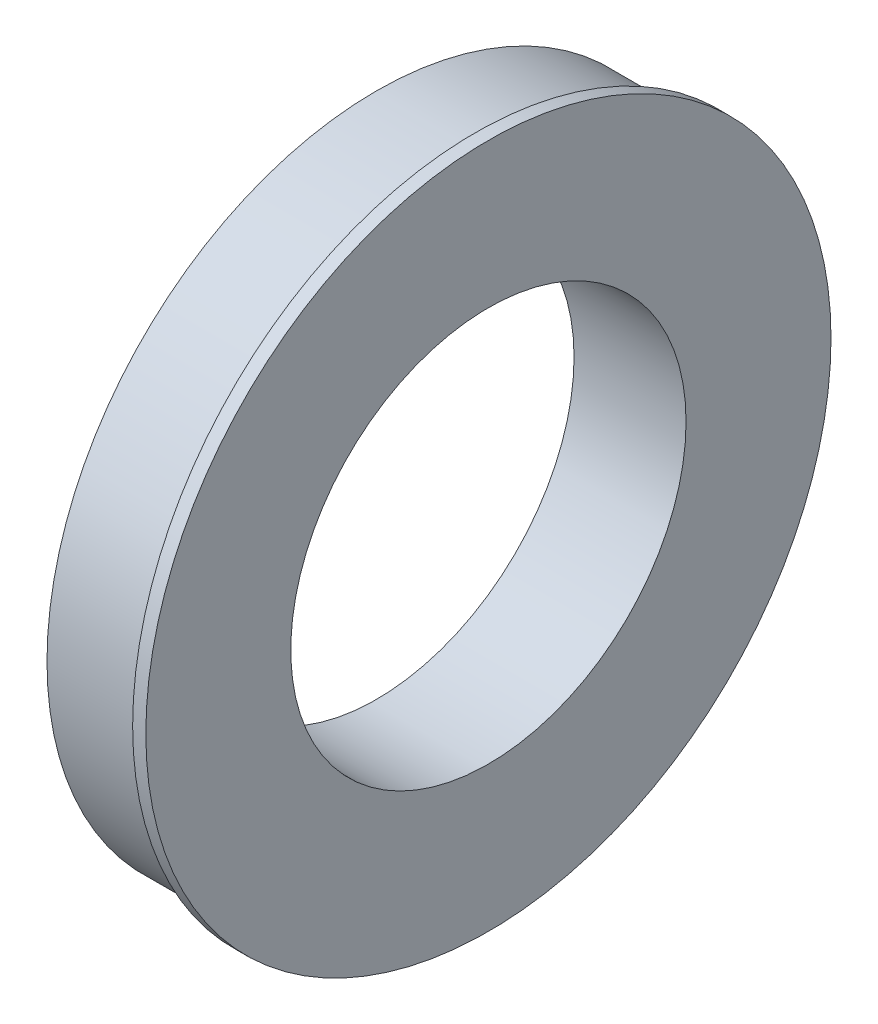
ISO-10303-21;
HEADER;
FILE_DESCRIPTION(('STEP AP214'),'2;1');
FILE_NAME('part.step','',(''),(''),'','','');
FILE_SCHEMA(('AUTOMOTIVE_DESIGN { 1 0 10303 214 1 1 1 1 }'));
ENDSEC;
DATA;
#1=APPLICATION_CONTEXT('core data for automotive mechanical design processes');
#2=APPLICATION_PROTOCOL_DEFINITION('international standard','automotive_design',2000,#1);
#3=PRODUCT_CONTEXT('',#1,'mechanical');
#4=PRODUCT('Part','Part','',(#3));
#5=PRODUCT_RELATED_PRODUCT_CATEGORY('part','',(#4));
#6=PRODUCT_DEFINITION_FORMATION('','',#4);
#7=PRODUCT_DEFINITION_CONTEXT('part definition',#1,'design');
#8=PRODUCT_DEFINITION('design','',#6,#7);
#9=PRODUCT_DEFINITION_SHAPE('','',#8);
#10=(LENGTH_UNIT() NAMED_UNIT(*) SI_UNIT(.MILLI.,.METRE.));
#11=(NAMED_UNIT(*) PLANE_ANGLE_UNIT() SI_UNIT($,.RADIAN.));
#12=(NAMED_UNIT(*) SI_UNIT($,.STERADIAN.) SOLID_ANGLE_UNIT());
#13=UNCERTAINTY_MEASURE_WITH_UNIT(LENGTH_MEASURE(1.E-05),#10,'distance_accuracy_value','');
#14=(GEOMETRIC_REPRESENTATION_CONTEXT(3) GLOBAL_UNCERTAINTY_ASSIGNED_CONTEXT((#13)) GLOBAL_UNIT_ASSIGNED_CONTEXT((#10,
#11,#12)) REPRESENTATION_CONTEXT('',''));
#15=CARTESIAN_POINT('',(0.,0.,0.));
#16=DIRECTION('',(0.,0.,1.));
#17=DIRECTION('',(1.,0.,0.));
#18=AXIS2_PLACEMENT_3D('',#15,#16,#17);
#19=CARTESIAN_POINT('',(-9.525,0.,0.));
#20=DIRECTION('',(1.,0.,0.));
#21=DIRECTION('',(0.,0.,-1.));
#22=AXIS2_PLACEMENT_3D('',#19,#20,#21);
#23=PLANE('',#22);
#24=CARTESIAN_POINT('',(-9.525,0.,0.));
#25=DIRECTION('',(1.,0.,0.));
#26=DIRECTION('',(0.,0.,-1.));
#27=AXIS2_PLACEMENT_3D('',#24,#25,#26);
#28=CIRCLE('',#27,63.5);
#29=CARTESIAN_POINT('',(-9.525,0.,-63.5));
#30=VERTEX_POINT('',#29);
#31=EDGE_CURVE('E45',#30,#30,#28,.T.);
#32=ORIENTED_EDGE('',*,*,#31,.F.);
#33=EDGE_LOOP('',(#32));
#34=FACE_BOUND('',#33,.T.);
#35=CARTESIAN_POINT('',(-9.525,0.,0.));
#36=DIRECTION('',(1.,0.,0.));
#37=DIRECTION('',(0.,0.,-1.));
#38=AXIS2_PLACEMENT_3D('',#35,#36,#37);
#39=CIRCLE('',#38,38.1);
#40=CARTESIAN_POINT('',(-9.525,0.,-38.1));
#41=VERTEX_POINT('',#40);
#42=EDGE_CURVE('E54',#41,#41,#39,.T.);
#43=ORIENTED_EDGE('',*,*,#42,.T.);
#44=EDGE_LOOP('',(#43));
#45=FACE_BOUND('',#44,.T.);
#46=ADVANCED_FACE('F41',(#34,#45),#23,.F.);
#47=CARTESIAN_POINT('',(9.525,0.,0.));
#48=DIRECTION('',(-1.,0.,0.));
#49=DIRECTION('',(0.,0.,1.));
#50=AXIS2_PLACEMENT_3D('',#47,#48,#49);
#51=CYLINDRICAL_SURFACE('',#50,63.5);
#52=CARTESIAN_POINT('',(9.525,0.,0.));
#53=DIRECTION('',(1.,0.,0.));
#54=DIRECTION('',(0.,0.,-1.));
#55=AXIS2_PLACEMENT_3D('',#52,#53,#54);
#56=CIRCLE('',#55,63.5);
#57=CARTESIAN_POINT('',(9.525,0.,-63.5));
#58=VERTEX_POINT('',#57);
#59=EDGE_CURVE('E10',#58,#58,#56,.T.);
#60=ORIENTED_EDGE('',*,*,#59,.F.);
#61=EDGE_LOOP('',(#60));
#62=FACE_BOUND('',#61,.T.);
#63=ORIENTED_EDGE('',*,*,#31,.T.);
#64=EDGE_LOOP('',(#63));
#65=FACE_BOUND('',#64,.T.);
#66=ADVANCED_FACE('F43',(#62,#65),#51,.T.);
#67=CARTESIAN_POINT('',(9.525,0.,0.));
#68=DIRECTION('',(-1.,0.,0.));
#69=DIRECTION('',(0.,0.,1.));
#70=AXIS2_PLACEMENT_3D('',#67,#68,#69);
#71=CYLINDRICAL_SURFACE('',#70,38.1);
#72=ORIENTED_EDGE('',*,*,#42,.F.);
#73=EDGE_LOOP('',(#72));
#74=FACE_BOUND('',#73,.T.);
#75=CARTESIAN_POINT('',(12.065,0.,0.));
#76=DIRECTION('',(1.,0.,0.));
#77=DIRECTION('',(0.,0.,-1.));
#78=AXIS2_PLACEMENT_3D('',#75,#76,#77);
#79=CIRCLE('',#78,38.1);
#80=CARTESIAN_POINT('',(12.065,0.,-38.1));
#81=VERTEX_POINT('',#80);
#82=EDGE_CURVE('E64',#81,#81,#79,.T.);
#83=ORIENTED_EDGE('',*,*,#82,.T.);
#84=EDGE_LOOP('',(#83));
#85=FACE_BOUND('',#84,.T.);
#86=ADVANCED_FACE('F72',(#74,#85),#71,.F.);
#87=CARTESIAN_POINT('',(12.065,0.,0.));
#88=DIRECTION('',(1.,0.,0.));
#89=DIRECTION('',(0.,0.,-1.));
#90=AXIS2_PLACEMENT_3D('',#87,#88,#89);
#91=PLANE('',#90);
#92=CARTESIAN_POINT('',(12.065,0.,0.));
#93=DIRECTION('',(1.,0.,0.));
#94=DIRECTION('',(0.,0.,-1.));
#95=AXIS2_PLACEMENT_3D('',#92,#93,#94);
#96=CIRCLE('',#95,66.04);
#97=CARTESIAN_POINT('',(12.065,0.,-66.04));
#98=VERTEX_POINT('',#97);
#99=EDGE_CURVE('E59',#98,#98,#96,.T.);
#100=ORIENTED_EDGE('',*,*,#99,.T.);
#101=EDGE_LOOP('',(#100));
#102=FACE_BOUND('',#101,.T.);
#103=ORIENTED_EDGE('',*,*,#82,.F.);
#104=EDGE_LOOP('',(#103));
#105=FACE_BOUND('',#104,.T.);
#106=ADVANCED_FACE('F74',(#102,#105),#91,.T.);
#107=CARTESIAN_POINT('',(9.525,0.,0.));
#108=DIRECTION('',(1.,0.,0.));
#109=DIRECTION('',(0.,0.,-1.));
#110=AXIS2_PLACEMENT_3D('',#107,#108,#109);
#111=PLANE('',#110);
#112=ORIENTED_EDGE('',*,*,#59,.T.);
#113=EDGE_LOOP('',(#112));
#114=FACE_BOUND('',#113,.T.);
#115=CARTESIAN_POINT('',(9.525,0.,0.));
#116=DIRECTION('',(1.,0.,0.));
#117=DIRECTION('',(0.,0.,-1.));
#118=AXIS2_PLACEMENT_3D('',#115,#116,#117);
#119=CIRCLE('',#118,66.04);
#120=CARTESIAN_POINT('',(9.525,0.,-66.04));
#121=VERTEX_POINT('',#120);
#122=EDGE_CURVE('E60',#121,#121,#119,.T.);
#123=ORIENTED_EDGE('',*,*,#122,.F.);
#124=EDGE_LOOP('',(#123));
#125=FACE_BOUND('',#124,.T.);
#126=ADVANCED_FACE('F76',(#114,#125),#111,.F.);
#127=CARTESIAN_POINT('',(12.065,0.,0.));
#128=DIRECTION('',(-1.,0.,0.));
#129=DIRECTION('',(0.,0.,1.));
#130=AXIS2_PLACEMENT_3D('',#127,#128,#129);
#131=CYLINDRICAL_SURFACE('',#130,66.04);
#132=ORIENTED_EDGE('',*,*,#99,.F.);
#133=EDGE_LOOP('',(#132));
#134=FACE_BOUND('',#133,.T.);
#135=ORIENTED_EDGE('',*,*,#122,.T.);
#136=EDGE_LOOP('',(#135));
#137=FACE_BOUND('',#136,.T.);
#138=ADVANCED_FACE('F83',(#134,#137),#131,.T.);
#139=CLOSED_SHELL('',(#46,#66,#86,#106,#126,#138));
#140=MANIFOLD_SOLID_BREP('B2',#139);
#141=ADVANCED_BREP_SHAPE_REPRESENTATION('',(#18,#140),#14);
#142=SHAPE_DEFINITION_REPRESENTATION(#9,#141);
ENDSEC;
END-ISO-10303-21;
